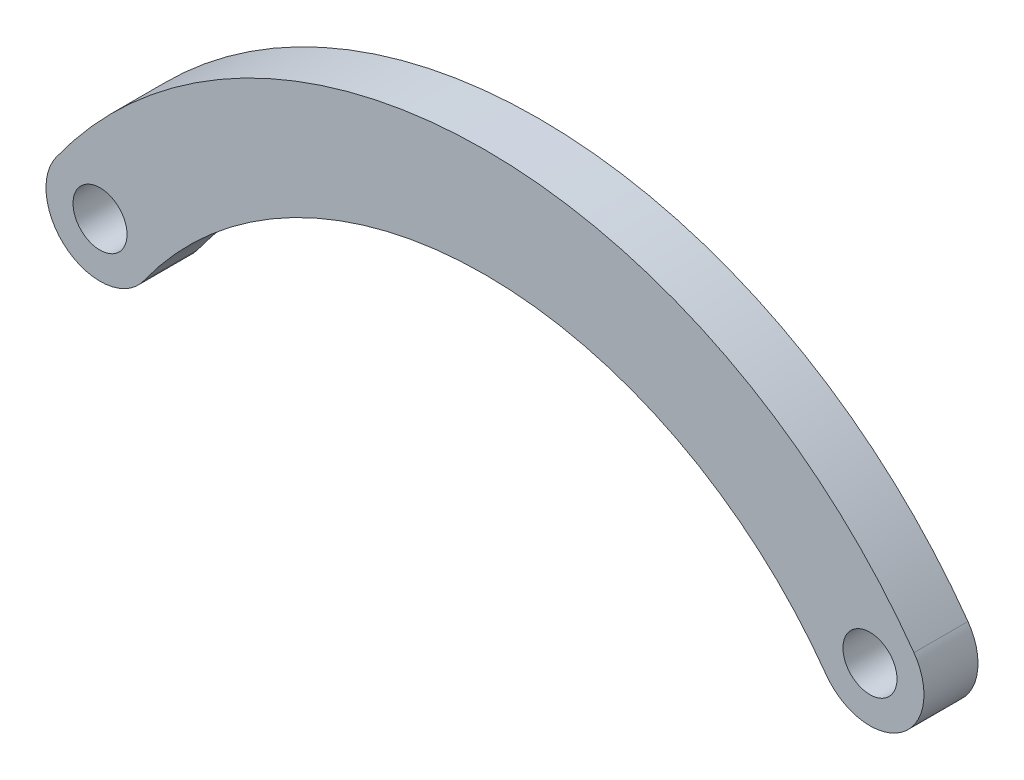
ISO-10303-21;
HEADER;
FILE_DESCRIPTION(('STEP AP214'),'2;1');
FILE_NAME('part.step','',(''),(''),'','','');
FILE_SCHEMA(('AUTOMOTIVE_DESIGN { 1 0 10303 214 1 1 1 1 }'));
ENDSEC;
DATA;
#1=APPLICATION_CONTEXT('core data for automotive mechanical design processes');
#2=APPLICATION_PROTOCOL_DEFINITION('international standard','automotive_design',2000,#1);
#3=PRODUCT_CONTEXT('',#1,'mechanical');
#4=PRODUCT('Part','Part','',(#3));
#5=PRODUCT_RELATED_PRODUCT_CATEGORY('part','',(#4));
#6=PRODUCT_DEFINITION_FORMATION('','',#4);
#7=PRODUCT_DEFINITION_CONTEXT('part definition',#1,'design');
#8=PRODUCT_DEFINITION('design','',#6,#7);
#9=PRODUCT_DEFINITION_SHAPE('','',#8);
#10=(LENGTH_UNIT() NAMED_UNIT(*) SI_UNIT(.MILLI.,.METRE.));
#11=(NAMED_UNIT(*) PLANE_ANGLE_UNIT() SI_UNIT($,.RADIAN.));
#12=(NAMED_UNIT(*) SI_UNIT($,.STERADIAN.) SOLID_ANGLE_UNIT());
#13=UNCERTAINTY_MEASURE_WITH_UNIT(LENGTH_MEASURE(1.E-05),#10,'distance_accuracy_value','');
#14=(GEOMETRIC_REPRESENTATION_CONTEXT(3) GLOBAL_UNCERTAINTY_ASSIGNED_CONTEXT((#13)) GLOBAL_UNIT_ASSIGNED_CONTEXT((#10,
#11,#12)) REPRESENTATION_CONTEXT('',''));
#15=CARTESIAN_POINT('',(0.,0.,0.));
#16=DIRECTION('',(0.,0.,1.));
#17=DIRECTION('',(1.,0.,0.));
#18=AXIS2_PLACEMENT_3D('',#15,#16,#17);
#19=CARTESIAN_POINT('',(-14.25,-10.158124826955,2.));
#20=DIRECTION('',(0.,0.,-1.));
#21=DIRECTION('',(-1.,0.,0.));
#22=AXIS2_PLACEMENT_3D('',#19,#20,#21);
#23=PLANE('',#22);
#24=CARTESIAN_POINT('',(-28.5,0.,2.));
#25=DIRECTION('',(0.,0.,1.));
#26=DIRECTION('',(-1.,0.,0.));
#27=AXIS2_PLACEMENT_3D('',#24,#25,#26);
#28=CIRCLE('',#27,4.);
#29=CARTESIAN_POINT('',(-31.7571428571429,2.32185710330401,2.));
#30=VERTEX_POINT('',#29);
#31=CARTESIAN_POINT('',(-25.2428571428571,-2.32185710330401,2.));
#32=VERTEX_POINT('',#31);
#33=EDGE_CURVE('E87',#30,#32,#28,.T.);
#34=ORIENTED_EDGE('',*,*,#33,.T.);
#35=CARTESIAN_POINT('',(0.,-20.31624965391,2.));
#36=DIRECTION('',(0.,0.,-1.));
#37=DIRECTION('',(-1.,0.,0.));
#38=AXIS2_PLACEMENT_3D('',#35,#36,#37);
#39=CIRCLE('',#38,31.);
#40=CARTESIAN_POINT('',(25.2428571428571,-2.321857103304,2.));
#41=VERTEX_POINT('',#40);
#42=EDGE_CURVE('E82',#32,#41,#39,.T.);
#43=ORIENTED_EDGE('',*,*,#42,.T.);
#44=CARTESIAN_POINT('',(28.5,0.,2.));
#45=DIRECTION('',(0.,0.,1.));
#46=DIRECTION('',(1.,0.,0.));
#47=AXIS2_PLACEMENT_3D('',#44,#45,#46);
#48=CIRCLE('',#47,4.);
#49=CARTESIAN_POINT('',(31.7571428571429,2.32185710330401,2.));
#50=VERTEX_POINT('',#49);
#51=EDGE_CURVE('E85',#41,#50,#48,.T.);
#52=ORIENTED_EDGE('',*,*,#51,.T.);
#53=CARTESIAN_POINT('',(0.,-20.31624965391,2.));
#54=DIRECTION('',(0.,0.,1.));
#55=DIRECTION('',(-1.,0.,0.));
#56=AXIS2_PLACEMENT_3D('',#53,#54,#55);
#57=CIRCLE('',#56,39.);
#58=EDGE_CURVE('E52',#50,#30,#57,.T.);
#59=ORIENTED_EDGE('',*,*,#58,.T.);
#60=EDGE_LOOP('',(#34,#43,#52,#59));
#61=FACE_BOUND('',#60,.T.);
#62=CARTESIAN_POINT('',(28.5,0.,2.));
#63=DIRECTION('',(0.,0.,1.));
#64=DIRECTION('',(1.,0.,0.));
#65=AXIS2_PLACEMENT_3D('',#62,#63,#64);
#66=CIRCLE('',#65,2.);
#67=CARTESIAN_POINT('',(30.5,0.,2.));
#68=VERTEX_POINT('',#67);
#69=EDGE_CURVE('E102',#68,#68,#66,.T.);
#70=ORIENTED_EDGE('',*,*,#69,.F.);
#71=EDGE_LOOP('',(#70));
#72=FACE_BOUND('',#71,.T.);
#73=CARTESIAN_POINT('',(-28.5,0.,2.));
#74=DIRECTION('',(0.,0.,1.));
#75=DIRECTION('',(1.,0.,0.));
#76=AXIS2_PLACEMENT_3D('',#73,#74,#75);
#77=CIRCLE('',#76,2.);
#78=CARTESIAN_POINT('',(-26.5,0.,2.));
#79=VERTEX_POINT('',#78);
#80=EDGE_CURVE('E117',#79,#79,#77,.T.);
#81=ORIENTED_EDGE('',*,*,#80,.F.);
#82=EDGE_LOOP('',(#81));
#83=FACE_BOUND('',#82,.T.);
#84=ADVANCED_FACE('F35',(#61,#72,#83),#23,.F.);
#85=CARTESIAN_POINT('',(-14.25,-10.158124826955,-2.));
#86=DIRECTION('',(0.,0.,-1.));
#87=DIRECTION('',(-1.,0.,0.));
#88=AXIS2_PLACEMENT_3D('',#85,#86,#87);
#89=PLANE('',#88);
#90=CARTESIAN_POINT('',(28.5,0.,-2.));
#91=DIRECTION('',(0.,0.,1.));
#92=DIRECTION('',(1.,0.,0.));
#93=AXIS2_PLACEMENT_3D('',#90,#91,#92);
#94=CIRCLE('',#93,2.);
#95=CARTESIAN_POINT('',(30.5,0.,-2.));
#96=VERTEX_POINT('',#95);
#97=EDGE_CURVE('E114',#96,#96,#94,.T.);
#98=ORIENTED_EDGE('',*,*,#97,.T.);
#99=EDGE_LOOP('',(#98));
#100=FACE_BOUND('',#99,.T.);
#101=CARTESIAN_POINT('',(-28.5,0.,-2.));
#102=DIRECTION('',(0.,0.,1.));
#103=DIRECTION('',(-1.,0.,0.));
#104=AXIS2_PLACEMENT_3D('',#101,#102,#103);
#105=CIRCLE('',#104,4.);
#106=CARTESIAN_POINT('',(-31.7571428571429,2.32185710330401,-2.));
#107=VERTEX_POINT('',#106);
#108=CARTESIAN_POINT('',(-25.2428571428571,-2.32185710330401,-2.));
#109=VERTEX_POINT('',#108);
#110=EDGE_CURVE('E99',#107,#109,#105,.T.);
#111=ORIENTED_EDGE('',*,*,#110,.F.);
#112=CARTESIAN_POINT('',(0.,-20.31624965391,-2.));
#113=DIRECTION('',(0.,0.,1.));
#114=DIRECTION('',(-1.,0.,0.));
#115=AXIS2_PLACEMENT_3D('',#112,#113,#114);
#116=CIRCLE('',#115,39.);
#117=CARTESIAN_POINT('',(31.7571428571429,2.32185710330401,-2.));
#118=VERTEX_POINT('',#117);
#119=EDGE_CURVE('E75',#118,#107,#116,.T.);
#120=ORIENTED_EDGE('',*,*,#119,.F.);
#121=CARTESIAN_POINT('',(28.5,0.,-2.));
#122=DIRECTION('',(0.,0.,1.));
#123=DIRECTION('',(1.,0.,0.));
#124=AXIS2_PLACEMENT_3D('',#121,#122,#123);
#125=CIRCLE('',#124,4.);
#126=CARTESIAN_POINT('',(25.2428571428571,-2.321857103304,-2.));
#127=VERTEX_POINT('',#126);
#128=EDGE_CURVE('E69',#127,#118,#125,.T.);
#129=ORIENTED_EDGE('',*,*,#128,.F.);
#130=CARTESIAN_POINT('',(0.,-20.31624965391,-2.));
#131=DIRECTION('',(0.,0.,-1.));
#132=DIRECTION('',(-1.,0.,0.));
#133=AXIS2_PLACEMENT_3D('',#130,#131,#132);
#134=CIRCLE('',#133,31.);
#135=EDGE_CURVE('E91',#109,#127,#134,.T.);
#136=ORIENTED_EDGE('',*,*,#135,.F.);
#137=EDGE_LOOP('',(#111,#120,#129,#136));
#138=FACE_BOUND('',#137,.T.);
#139=CARTESIAN_POINT('',(-28.5,0.,-2.));
#140=DIRECTION('',(0.,0.,1.));
#141=DIRECTION('',(1.,0.,0.));
#142=AXIS2_PLACEMENT_3D('',#139,#140,#141);
#143=CIRCLE('',#142,2.);
#144=CARTESIAN_POINT('',(-26.5,0.,-2.));
#145=VERTEX_POINT('',#144);
#146=EDGE_CURVE('E120',#145,#145,#143,.T.);
#147=ORIENTED_EDGE('',*,*,#146,.T.);
#148=EDGE_LOOP('',(#147));
#149=FACE_BOUND('',#148,.T.);
#150=ADVANCED_FACE('F110',(#100,#138,#149),#89,.T.);
#151=CARTESIAN_POINT('',(-28.5,0.,2.));
#152=DIRECTION('',(0.,0.,-1.));
#153=DIRECTION('',(-1.,0.,0.));
#154=AXIS2_PLACEMENT_3D('',#151,#152,#153);
#155=CYLINDRICAL_SURFACE('',#154,4.);
#156=ORIENTED_EDGE('',*,*,#110,.T.);
#157=DIRECTION('',(0.,0.,-1.));
#158=VECTOR('',#157,1.);
#159=CARTESIAN_POINT('',(-25.2428571428571,-2.32185710330401,2.));
#160=LINE('',#159,#158);
#161=EDGE_CURVE('E11',#32,#109,#160,.T.);
#162=ORIENTED_EDGE('',*,*,#161,.F.);
#163=ORIENTED_EDGE('',*,*,#33,.F.);
#164=DIRECTION('',(0.,0.,-1.));
#165=VECTOR('',#164,1.);
#166=CARTESIAN_POINT('',(-31.7571428571429,2.32185710330401,2.));
#167=LINE('',#166,#165);
#168=EDGE_CURVE('E95',#30,#107,#167,.T.);
#169=ORIENTED_EDGE('',*,*,#168,.T.);
#170=EDGE_LOOP('',(#156,#162,#163,#169));
#171=FACE_BOUND('',#170,.T.);
#172=ADVANCED_FACE('F37',(#171),#155,.T.);
#173=CARTESIAN_POINT('',(0.,-20.31624965391,2.));
#174=DIRECTION('',(0.,0.,-1.));
#175=DIRECTION('',(-1.,0.,0.));
#176=AXIS2_PLACEMENT_3D('',#173,#174,#175);
#177=CYLINDRICAL_SURFACE('',#176,31.);
#178=ORIENTED_EDGE('',*,*,#135,.T.);
#179=DIRECTION('',(0.,0.,-1.));
#180=VECTOR('',#179,1.);
#181=CARTESIAN_POINT('',(25.2428571428571,-2.321857103304,2.));
#182=LINE('',#181,#180);
#183=EDGE_CURVE('E44',#41,#127,#182,.T.);
#184=ORIENTED_EDGE('',*,*,#183,.F.);
#185=ORIENTED_EDGE('',*,*,#42,.F.);
#186=ORIENTED_EDGE('',*,*,#161,.T.);
#187=EDGE_LOOP('',(#178,#184,#185,#186));
#188=FACE_BOUND('',#187,.T.);
#189=ADVANCED_FACE('F90',(#188),#177,.F.);
#190=CARTESIAN_POINT('',(28.5,0.,2.));
#191=DIRECTION('',(0.,0.,-1.));
#192=DIRECTION('',(-1.,0.,0.));
#193=AXIS2_PLACEMENT_3D('',#190,#191,#192);
#194=CYLINDRICAL_SURFACE('',#193,4.);
#195=ORIENTED_EDGE('',*,*,#128,.T.);
#196=DIRECTION('',(0.,0.,-1.));
#197=VECTOR('',#196,1.);
#198=CARTESIAN_POINT('',(31.7571428571429,2.32185710330401,2.));
#199=LINE('',#198,#197);
#200=EDGE_CURVE('E92',#50,#118,#199,.T.);
#201=ORIENTED_EDGE('',*,*,#200,.F.);
#202=ORIENTED_EDGE('',*,*,#51,.F.);
#203=ORIENTED_EDGE('',*,*,#183,.T.);
#204=EDGE_LOOP('',(#195,#201,#202,#203));
#205=FACE_BOUND('',#204,.T.);
#206=ADVANCED_FACE('F93',(#205),#194,.T.);
#207=CARTESIAN_POINT('',(0.,-20.31624965391,2.));
#208=DIRECTION('',(0.,0.,-1.));
#209=DIRECTION('',(-1.,0.,0.));
#210=AXIS2_PLACEMENT_3D('',#207,#208,#209);
#211=CYLINDRICAL_SURFACE('',#210,39.);
#212=ORIENTED_EDGE('',*,*,#119,.T.);
#213=ORIENTED_EDGE('',*,*,#168,.F.);
#214=ORIENTED_EDGE('',*,*,#58,.F.);
#215=ORIENTED_EDGE('',*,*,#200,.T.);
#216=EDGE_LOOP('',(#212,#213,#214,#215));
#217=FACE_BOUND('',#216,.T.);
#218=ADVANCED_FACE('F107',(#217),#211,.T.);
#219=CARTESIAN_POINT('',(28.5,0.,2.));
#220=DIRECTION('',(0.,0.,-1.));
#221=DIRECTION('',(-1.,0.,0.));
#222=AXIS2_PLACEMENT_3D('',#219,#220,#221);
#223=CYLINDRICAL_SURFACE('',#222,2.);
#224=ORIENTED_EDGE('',*,*,#69,.T.);
#225=EDGE_LOOP('',(#224));
#226=FACE_BOUND('',#225,.T.);
#227=ORIENTED_EDGE('',*,*,#97,.F.);
#228=EDGE_LOOP('',(#227));
#229=FACE_BOUND('',#228,.T.);
#230=ADVANCED_FACE('F137',(#226,#229),#223,.F.);
#231=CARTESIAN_POINT('',(-28.5,0.,2.));
#232=DIRECTION('',(0.,0.,-1.));
#233=DIRECTION('',(-1.,0.,0.));
#234=AXIS2_PLACEMENT_3D('',#231,#232,#233);
#235=CYLINDRICAL_SURFACE('',#234,2.);
#236=ORIENTED_EDGE('',*,*,#80,.T.);
#237=EDGE_LOOP('',(#236));
#238=FACE_BOUND('',#237,.T.);
#239=ORIENTED_EDGE('',*,*,#146,.F.);
#240=EDGE_LOOP('',(#239));
#241=FACE_BOUND('',#240,.T.);
#242=ADVANCED_FACE('F126',(#238,#241),#235,.F.);
#243=CLOSED_SHELL('',(#84,#150,#172,#189,#206,#218,#230,#242));
#244=MANIFOLD_SOLID_BREP('B2',#243);
#245=ADVANCED_BREP_SHAPE_REPRESENTATION('',(#18,#244),#14);
#246=SHAPE_DEFINITION_REPRESENTATION(#9,#245);
ENDSEC;
END-ISO-10303-21;
